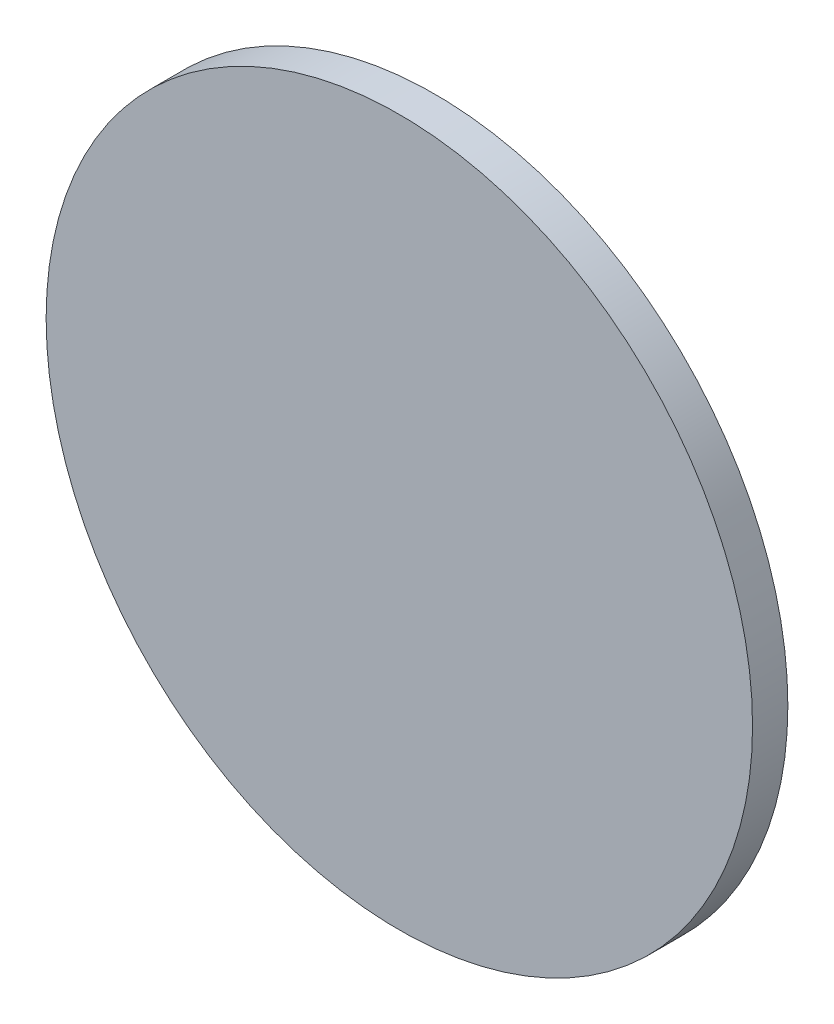
ISO-10303-21;
HEADER;
FILE_DESCRIPTION(('STEP AP214'),'2;1');
FILE_NAME('part.step','',(''),(''),'','','');
FILE_SCHEMA(('AUTOMOTIVE_DESIGN { 1 0 10303 214 1 1 1 1 }'));
ENDSEC;
DATA;
#1=APPLICATION_CONTEXT('core data for automotive mechanical design processes');
#2=APPLICATION_PROTOCOL_DEFINITION('international standard','automotive_design',2000,#1);
#3=PRODUCT_CONTEXT('',#1,'mechanical');
#4=PRODUCT('Part','Part','',(#3));
#5=PRODUCT_RELATED_PRODUCT_CATEGORY('part','',(#4));
#6=PRODUCT_DEFINITION_FORMATION('','',#4);
#7=PRODUCT_DEFINITION_CONTEXT('part definition',#1,'design');
#8=PRODUCT_DEFINITION('design','',#6,#7);
#9=PRODUCT_DEFINITION_SHAPE('','',#8);
#10=(LENGTH_UNIT() NAMED_UNIT(*) SI_UNIT(.MILLI.,.METRE.));
#11=(NAMED_UNIT(*) PLANE_ANGLE_UNIT() SI_UNIT($,.RADIAN.));
#12=(NAMED_UNIT(*) SI_UNIT($,.STERADIAN.) SOLID_ANGLE_UNIT());
#13=UNCERTAINTY_MEASURE_WITH_UNIT(LENGTH_MEASURE(1.E-05),#10,'distance_accuracy_value','');
#14=(GEOMETRIC_REPRESENTATION_CONTEXT(3) GLOBAL_UNCERTAINTY_ASSIGNED_CONTEXT((#13)) GLOBAL_UNIT_ASSIGNED_CONTEXT((#10,
#11,#12)) REPRESENTATION_CONTEXT('',''));
#15=CARTESIAN_POINT('',(0.,0.,0.));
#16=DIRECTION('',(0.,0.,1.));
#17=DIRECTION('',(1.,0.,0.));
#18=AXIS2_PLACEMENT_3D('',#15,#16,#17);
#19=CARTESIAN_POINT('',(0.0999998,0.,0.00999998));
#20=DIRECTION('',(0.,0.,-1.));
#21=DIRECTION('',(0.,-1.,0.));
#22=AXIS2_PLACEMENT_3D('',#19,#20,#21);
#23=PLANE('',#22);
#24=CARTESIAN_POINT('',(0.,0.,0.00999998));
#25=DIRECTION('',(0.,0.,1.));
#26=DIRECTION('',(1.,0.,0.));
#27=AXIS2_PLACEMENT_3D('',#24,#25,#26);
#28=CIRCLE('',#27,0.0999998);
#29=CARTESIAN_POINT('',(0.0999998,0.,0.00999998));
#30=VERTEX_POINT('',#29);
#31=EDGE_CURVE('E11',#30,#30,#28,.T.);
#32=ORIENTED_EDGE('',*,*,#31,.T.);
#33=EDGE_LOOP('',(#32));
#34=FACE_BOUND('',#33,.T.);
#35=ADVANCED_FACE('F17',(#34),#23,.F.);
#36=CARTESIAN_POINT('',(0.0999998,0.,0.));
#37=DIRECTION('',(0.,0.,-1.));
#38=DIRECTION('',(0.,-1.,0.));
#39=AXIS2_PLACEMENT_3D('',#36,#37,#38);
#40=PLANE('',#39);
#41=CARTESIAN_POINT('',(0.,0.,0.));
#42=DIRECTION('',(0.,0.,1.));
#43=DIRECTION('',(1.,0.,0.));
#44=AXIS2_PLACEMENT_3D('',#41,#42,#43);
#45=CIRCLE('',#44,0.0999998);
#46=CARTESIAN_POINT('',(0.0999998,0.,0.));
#47=VERTEX_POINT('',#46);
#48=EDGE_CURVE('E42',#47,#47,#45,.T.);
#49=ORIENTED_EDGE('',*,*,#48,.F.);
#50=EDGE_LOOP('',(#49));
#51=FACE_BOUND('',#50,.T.);
#52=ADVANCED_FACE('F64',(#51),#40,.T.);
#53=CARTESIAN_POINT('',(0.,0.,0.));
#54=DIRECTION('',(0.,0.,-1.));
#55=DIRECTION('',(1.,0.,0.));
#56=AXIS2_PLACEMENT_3D('',#53,#54,#55);
#57=CYLINDRICAL_SURFACE('',#56,0.0999998);
#58=ORIENTED_EDGE('',*,*,#48,.T.);
#59=DIRECTION('',(0.,0.,1.));
#60=VECTOR('',#59,1.);
#61=CARTESIAN_POINT('',(0.0999998,0.,0.));
#62=LINE('',#61,#60);
#63=EDGE_CURVE('E25',#47,#30,#62,.T.);
#64=ORIENTED_EDGE('',*,*,#63,.T.);
#65=ORIENTED_EDGE('',*,*,#31,.F.);
#66=ORIENTED_EDGE('',*,*,#63,.F.);
#67=EDGE_LOOP('',(#58,#64,#65,#66));
#68=FACE_BOUND('',#67,.T.);
#69=ADVANCED_FACE('F40',(#68),#57,.T.);
#70=CLOSED_SHELL('',(#35,#52,#69));
#71=MANIFOLD_SOLID_BREP('B1',#70);
#72=ADVANCED_BREP_SHAPE_REPRESENTATION('',(#18,#71),#14);
#73=SHAPE_DEFINITION_REPRESENTATION(#9,#72);
ENDSEC;
END-ISO-10303-21;
